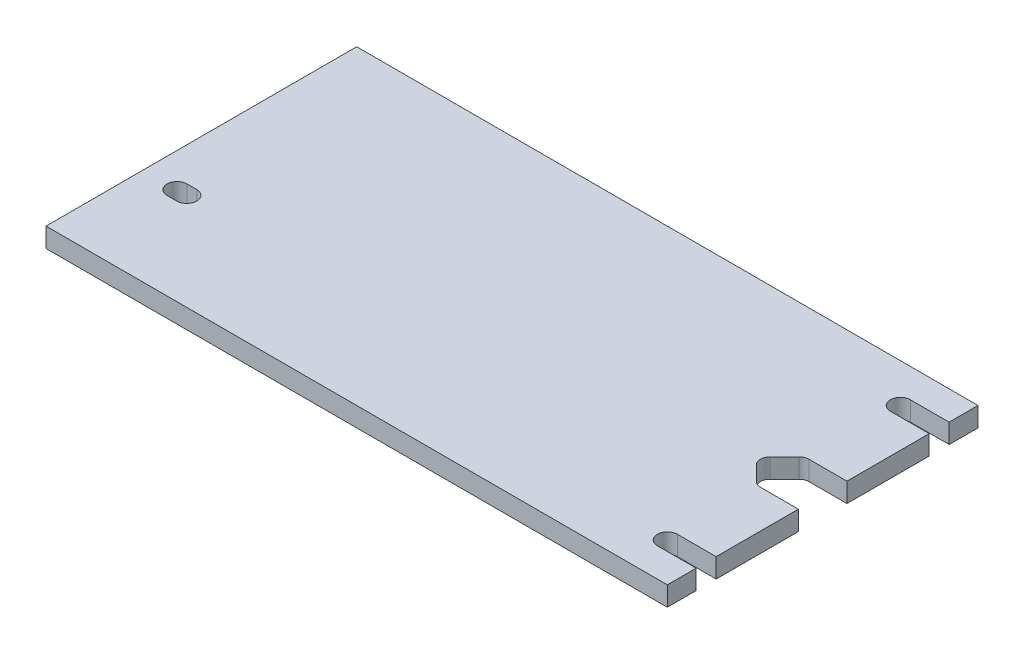
ISO-10303-21;
HEADER;
FILE_DESCRIPTION(('STEP AP214'),'2;1');
FILE_NAME('part.step','',(''),(''),'','','');
FILE_SCHEMA(('AUTOMOTIVE_DESIGN { 1 0 10303 214 1 1 1 1 }'));
ENDSEC;
DATA;
#1=APPLICATION_CONTEXT('core data for automotive mechanical design processes');
#2=APPLICATION_PROTOCOL_DEFINITION('international standard','automotive_design',2000,#1);
#3=PRODUCT_CONTEXT('',#1,'mechanical');
#4=PRODUCT('Part','Part','',(#3));
#5=PRODUCT_RELATED_PRODUCT_CATEGORY('part','',(#4));
#6=PRODUCT_DEFINITION_FORMATION('','',#4);
#7=PRODUCT_DEFINITION_CONTEXT('part definition',#1,'design');
#8=PRODUCT_DEFINITION('design','',#6,#7);
#9=PRODUCT_DEFINITION_SHAPE('','',#8);
#10=(LENGTH_UNIT() NAMED_UNIT(*) SI_UNIT(.MILLI.,.METRE.));
#11=(NAMED_UNIT(*) PLANE_ANGLE_UNIT() SI_UNIT($,.RADIAN.));
#12=(NAMED_UNIT(*) SI_UNIT($,.STERADIAN.) SOLID_ANGLE_UNIT());
#13=UNCERTAINTY_MEASURE_WITH_UNIT(LENGTH_MEASURE(1.E-05),#10,'distance_accuracy_value','');
#14=(GEOMETRIC_REPRESENTATION_CONTEXT(3) GLOBAL_UNCERTAINTY_ASSIGNED_CONTEXT((#13)) GLOBAL_UNIT_ASSIGNED_CONTEXT((#10,
#11,#12)) REPRESENTATION_CONTEXT('',''));
#15=CARTESIAN_POINT('',(0.,0.,0.));
#16=DIRECTION('',(0.,0.,1.));
#17=DIRECTION('',(1.,0.,0.));
#18=AXIS2_PLACEMENT_3D('',#15,#16,#17);
#19=CARTESIAN_POINT('',(101.6,6.35,7.9375));
#20=DIRECTION('',(-1.,0.,0.));
#21=DIRECTION('',(0.,0.,1.));
#22=AXIS2_PLACEMENT_3D('',#19,#20,#21);
#23=PLANE('',#22);
#24=DIRECTION('',(0.,1.,0.));
#25=VECTOR('',#24,1.);
#26=CARTESIAN_POINT('',(101.6,-0.00100000000000013,34.8361));
#27=LINE('',#26,#25);
#28=CARTESIAN_POINT('',(101.6,0.,34.8361));
#29=VERTEX_POINT('',#28);
#30=CARTESIAN_POINT('',(101.6,6.35,34.8361));
#31=VERTEX_POINT('',#30);
#32=EDGE_CURVE('E247',#29,#31,#27,.T.);
#33=ORIENTED_EDGE('',*,*,#32,.F.);
#34=DIRECTION('',(0.,0.,-1.));
#35=VECTOR('',#34,1.);
#36=CARTESIAN_POINT('',(101.6,0.,7.9375));
#37=LINE('',#36,#35);
#38=CARTESIAN_POINT('',(101.6,0.,7.9375));
#39=VERTEX_POINT('',#38);
#40=EDGE_CURVE('E282',#29,#39,#37,.T.);
#41=ORIENTED_EDGE('',*,*,#40,.T.);
#42=DIRECTION('',(0.,-1.,0.));
#43=VECTOR('',#42,1.);
#44=CARTESIAN_POINT('',(101.6,6.35,7.9375));
#45=LINE('',#44,#43);
#46=CARTESIAN_POINT('',(101.6,6.35,7.9375));
#47=VERTEX_POINT('',#46);
#48=EDGE_CURVE('E11',#47,#39,#45,.T.);
#49=ORIENTED_EDGE('',*,*,#48,.F.);
#50=DIRECTION('',(0.,0.,-1.));
#51=VECTOR('',#50,1.);
#52=CARTESIAN_POINT('',(101.6,6.35,7.9375));
#53=LINE('',#52,#51);
#54=EDGE_CURVE('E287',#31,#47,#53,.T.);
#55=ORIENTED_EDGE('',*,*,#54,.F.);
#56=EDGE_LOOP('',(#33,#41,#49,#55));
#57=FACE_BOUND('',#56,.T.);
#58=ADVANCED_FACE('F32',(#57),#23,.F.);
#59=DIRECTION('',(0.,1.,0.));
#60=VECTOR('',#59,1.);
#61=CARTESIAN_POINT('',(101.6,-0.00100000000000013,41.3639));
#62=LINE('',#61,#60);
#63=CARTESIAN_POINT('',(101.6,0.,41.3639));
#64=VERTEX_POINT('',#63);
#65=CARTESIAN_POINT('',(101.6,6.35,41.3639));
#66=VERTEX_POINT('',#65);
#67=EDGE_CURVE('E246',#64,#66,#62,.T.);
#68=ORIENTED_EDGE('',*,*,#67,.T.);
#69=CARTESIAN_POINT('',(101.6,6.35,50.8));
#70=VERTEX_POINT('',#69);
#71=EDGE_CURVE('E283',#70,#66,#53,.T.);
#72=ORIENTED_EDGE('',*,*,#71,.F.);
#73=DIRECTION('',(0.,-1.,0.));
#74=VECTOR('',#73,1.);
#75=CARTESIAN_POINT('',(101.6,6.35,50.8));
#76=LINE('',#75,#74);
#77=CARTESIAN_POINT('',(101.6,0.,50.8));
#78=VERTEX_POINT('',#77);
#79=EDGE_CURVE('E311',#70,#78,#76,.T.);
#80=ORIENTED_EDGE('',*,*,#79,.T.);
#81=EDGE_CURVE('E312',#78,#64,#37,.T.);
#82=ORIENTED_EDGE('',*,*,#81,.T.);
#83=EDGE_LOOP('',(#68,#72,#80,#82));
#84=FACE_BOUND('',#83,.T.);
#85=ADVANCED_FACE('F407',(#84),#23,.F.);
#86=CARTESIAN_POINT('',(89.1723719394654,6.35,-4.7625));
#87=DIRECTION('',(0.,1.,0.));
#88=DIRECTION('',(0.,0.,1.));
#89=AXIS2_PLACEMENT_3D('',#86,#87,#88);
#90=PLANE('',#89);
#91=DIRECTION('',(-1.,0.,0.));
#92=VECTOR('',#91,1.);
#93=CARTESIAN_POINT('',(-90.4875,6.35,15.7861));
#94=LINE('',#93,#92);
#95=CARTESIAN_POINT('',(-87.3125,6.35,15.7861));
#96=VERTEX_POINT('',#95);
#97=CARTESIAN_POINT('',(-90.4875,6.35,15.7861));
#98=VERTEX_POINT('',#97);
#99=EDGE_CURVE('E203',#96,#98,#94,.T.);
#100=ORIENTED_EDGE('',*,*,#99,.F.);
#101=CARTESIAN_POINT('',(-87.3125,6.35,19.05));
#102=DIRECTION('',(0.,1.,0.));
#103=DIRECTION('',(0.,0.,1.));
#104=AXIS2_PLACEMENT_3D('',#101,#102,#103);
#105=CIRCLE('',#104,3.26389999999999);
#106=CARTESIAN_POINT('',(-87.3125,6.35,22.3139));
#107=VERTEX_POINT('',#106);
#108=EDGE_CURVE('E210',#107,#96,#105,.T.);
#109=ORIENTED_EDGE('',*,*,#108,.F.);
#110=DIRECTION('',(1.,0.,0.));
#111=VECTOR('',#110,1.);
#112=CARTESIAN_POINT('',(-90.4875,6.35,22.3139));
#113=LINE('',#112,#111);
#114=CARTESIAN_POINT('',(-90.4875,6.35,22.3139));
#115=VERTEX_POINT('',#114);
#116=EDGE_CURVE('E192',#115,#107,#113,.T.);
#117=ORIENTED_EDGE('',*,*,#116,.F.);
#118=CARTESIAN_POINT('',(-90.4875,6.35,19.05));
#119=DIRECTION('',(0.,1.,0.));
#120=DIRECTION('',(0.,0.,1.));
#121=AXIS2_PLACEMENT_3D('',#118,#119,#120);
#122=CIRCLE('',#121,3.26389999999999);
#123=EDGE_CURVE('E204',#98,#115,#122,.T.);
#124=ORIENTED_EDGE('',*,*,#123,.F.);
#125=EDGE_LOOP('',(#100,#109,#117,#124));
#126=FACE_BOUND('',#125,.T.);
#127=CARTESIAN_POINT('',(88.9,6.35,38.1));
#128=DIRECTION('',(0.,1.,0.));
#129=DIRECTION('',(0.,0.,1.));
#130=AXIS2_PLACEMENT_3D('',#127,#128,#129);
#131=CIRCLE('',#130,3.26389999999999);
#132=CARTESIAN_POINT('',(88.9,6.35,34.8361));
#133=VERTEX_POINT('',#132);
#134=CARTESIAN_POINT('',(88.9,6.35,41.3639));
#135=VERTEX_POINT('',#134);
#136=EDGE_CURVE('E270',#133,#135,#131,.T.);
#137=ORIENTED_EDGE('',*,*,#136,.F.);
#138=DIRECTION('',(1.,0.,0.));
#139=VECTOR('',#138,1.);
#140=CARTESIAN_POINT('',(88.9,6.35,34.8361));
#141=LINE('',#140,#139);
#142=EDGE_CURVE('E46',#133,#31,#141,.T.);
#143=ORIENTED_EDGE('',*,*,#142,.T.);
#144=ORIENTED_EDGE('',*,*,#54,.T.);
#145=DIRECTION('',(-1.,0.,0.));
#146=VECTOR('',#145,1.);
#147=CARTESIAN_POINT('',(89.1723719394654,6.35,7.9375));
#148=LINE('',#147,#146);
#149=CARTESIAN_POINT('',(89.1723719394654,6.35,7.9375));
#150=VERTEX_POINT('',#149);
#151=EDGE_CURVE('E286',#47,#150,#148,.T.);
#152=ORIENTED_EDGE('',*,*,#151,.T.);
#153=CARTESIAN_POINT('',(89.1723719394654,6.35,4.7625));
#154=DIRECTION('',(0.,-1.,0.));
#155=DIRECTION('',(0.,0.,1.));
#156=AXIS2_PLACEMENT_3D('',#153,#154,#155);
#157=CIRCLE('',#156,3.175);
#158=CARTESIAN_POINT('',(86.9273079091981,6.35,7.00756403026728));
#159=VERTEX_POINT('',#158);
#160=EDGE_CURVE('E289',#150,#159,#157,.T.);
#161=ORIENTED_EDGE('',*,*,#160,.T.);
#162=DIRECTION('',(-0.707106781186548,0.,-0.707106781186547));
#163=VECTOR('',#162,1.);
#164=CARTESIAN_POINT('',(86.9273079091981,6.35,7.00756403026728));
#165=LINE('',#164,#163);
#166=CARTESIAN_POINT('',(82.1648079091981,6.35,2.24506403026729));
#167=VERTEX_POINT('',#166);
#168=EDGE_CURVE('E291',#159,#167,#165,.T.);
#169=ORIENTED_EDGE('',*,*,#168,.T.);
#170=CARTESIAN_POINT('',(84.4098719394654,6.35,0.));
#171=DIRECTION('',(0.,-1.,0.));
#172=DIRECTION('',(0.,0.,1.));
#173=AXIS2_PLACEMENT_3D('',#170,#171,#172);
#174=CIRCLE('',#173,3.175);
#175=CARTESIAN_POINT('',(82.1648079091981,6.35,-2.24506403026729));
#176=VERTEX_POINT('',#175);
#177=EDGE_CURVE('E293',#167,#176,#174,.T.);
#178=ORIENTED_EDGE('',*,*,#177,.T.);
#179=DIRECTION('',(0.707106781186548,0.,-0.707106781186547));
#180=VECTOR('',#179,1.);
#181=CARTESIAN_POINT('',(86.9273079091981,6.35,-7.00756403026728));
#182=LINE('',#181,#180);
#183=CARTESIAN_POINT('',(86.9273079091981,6.35,-7.00756403026728));
#184=VERTEX_POINT('',#183);
#185=EDGE_CURVE('E295',#176,#184,#182,.T.);
#186=ORIENTED_EDGE('',*,*,#185,.T.);
#187=CARTESIAN_POINT('',(89.1723719394654,6.35,-4.7625));
#188=DIRECTION('',(0.,-1.,0.));
#189=DIRECTION('',(0.,0.,1.));
#190=AXIS2_PLACEMENT_3D('',#187,#188,#189);
#191=CIRCLE('',#190,3.175);
#192=CARTESIAN_POINT('',(89.1723719394654,6.35,-7.9375));
#193=VERTEX_POINT('',#192);
#194=EDGE_CURVE('E297',#184,#193,#191,.T.);
#195=ORIENTED_EDGE('',*,*,#194,.T.);
#196=DIRECTION('',(1.,0.,0.));
#197=VECTOR('',#196,1.);
#198=CARTESIAN_POINT('',(89.1723719394654,6.35,-7.9375));
#199=LINE('',#198,#197);
#200=CARTESIAN_POINT('',(101.6,6.35,-7.9375));
#201=VERTEX_POINT('',#200);
#202=EDGE_CURVE('E299',#193,#201,#199,.T.);
#203=ORIENTED_EDGE('',*,*,#202,.T.);
#204=DIRECTION('',(0.,0.,-1.));
#205=VECTOR('',#204,1.);
#206=CARTESIAN_POINT('',(101.6,6.35,-50.8));
#207=LINE('',#206,#205);
#208=CARTESIAN_POINT('',(101.6,6.35,-34.8361));
#209=VERTEX_POINT('',#208);
#210=EDGE_CURVE('E302',#201,#209,#207,.T.);
#211=ORIENTED_EDGE('',*,*,#210,.T.);
#212=DIRECTION('',(1.,0.,0.));
#213=VECTOR('',#212,1.);
#214=CARTESIAN_POINT('',(88.9,6.35,-34.8361));
#215=LINE('',#214,#213);
#216=CARTESIAN_POINT('',(88.9,6.35,-34.8361));
#217=VERTEX_POINT('',#216);
#218=EDGE_CURVE('E259',#217,#209,#215,.T.);
#219=ORIENTED_EDGE('',*,*,#218,.F.);
#220=CARTESIAN_POINT('',(88.9,6.35,-38.1));
#221=DIRECTION('',(0.,1.,0.));
#222=DIRECTION('',(0.,0.,1.));
#223=AXIS2_PLACEMENT_3D('',#220,#221,#222);
#224=CIRCLE('',#223,3.26389999999999);
#225=CARTESIAN_POINT('',(88.9,6.35,-41.3639));
#226=VERTEX_POINT('',#225);
#227=EDGE_CURVE('E276',#226,#217,#224,.T.);
#228=ORIENTED_EDGE('',*,*,#227,.F.);
#229=DIRECTION('',(-1.,0.,0.));
#230=VECTOR('',#229,1.);
#231=CARTESIAN_POINT('',(88.9,6.35,-41.3639));
#232=LINE('',#231,#230);
#233=CARTESIAN_POINT('',(101.6,6.35,-41.3639));
#234=VERTEX_POINT('',#233);
#235=EDGE_CURVE('E261',#234,#226,#232,.T.);
#236=ORIENTED_EDGE('',*,*,#235,.F.);
#237=CARTESIAN_POINT('',(101.6,6.35,-50.8));
#238=VERTEX_POINT('',#237);
#239=EDGE_CURVE('E301',#234,#238,#207,.T.);
#240=ORIENTED_EDGE('',*,*,#239,.T.);
#241=DIRECTION('',(-1.,0.,0.));
#242=VECTOR('',#241,1.);
#243=CARTESIAN_POINT('',(-101.6,6.35,-50.8));
#244=LINE('',#243,#242);
#245=CARTESIAN_POINT('',(-101.6,6.35,-50.8));
#246=VERTEX_POINT('',#245);
#247=EDGE_CURVE('E305',#238,#246,#244,.T.);
#248=ORIENTED_EDGE('',*,*,#247,.T.);
#249=DIRECTION('',(0.,0.,1.));
#250=VECTOR('',#249,1.);
#251=CARTESIAN_POINT('',(-101.6,6.35,-50.8));
#252=LINE('',#251,#250);
#253=CARTESIAN_POINT('',(-101.6,6.35,50.8));
#254=VERTEX_POINT('',#253);
#255=EDGE_CURVE('E307',#246,#254,#252,.T.);
#256=ORIENTED_EDGE('',*,*,#255,.T.);
#257=DIRECTION('',(1.,0.,0.));
#258=VECTOR('',#257,1.);
#259=CARTESIAN_POINT('',(-101.6,6.35,50.8));
#260=LINE('',#259,#258);
#261=EDGE_CURVE('E309',#254,#70,#260,.T.);
#262=ORIENTED_EDGE('',*,*,#261,.T.);
#263=ORIENTED_EDGE('',*,*,#71,.T.);
#264=DIRECTION('',(-1.,0.,0.));
#265=VECTOR('',#264,1.);
#266=CARTESIAN_POINT('',(88.9,6.35,41.3639));
#267=LINE('',#266,#265);
#268=EDGE_CURVE('E242',#66,#135,#267,.T.);
#269=ORIENTED_EDGE('',*,*,#268,.T.);
#270=EDGE_LOOP('',(#137,#143,#144,#152,#161,#169,#178,#186,#195,#203,#211,#219,#228,#236,#240,
#248,#256,#262,#263,#269));
#271=FACE_BOUND('',#270,.T.);
#272=ADVANCED_FACE('F215',(#126,#271),#90,.T.);
#273=CARTESIAN_POINT('',(89.1723719394654,0.,-4.7625));
#274=DIRECTION('',(0.,1.,0.));
#275=DIRECTION('',(0.,0.,1.));
#276=AXIS2_PLACEMENT_3D('',#273,#274,#275);
#277=PLANE('',#276);
#278=CARTESIAN_POINT('',(-87.3125,0.,19.05));
#279=DIRECTION('',(0.,1.,0.));
#280=DIRECTION('',(0.,0.,1.));
#281=AXIS2_PLACEMENT_3D('',#278,#279,#280);
#282=CIRCLE('',#281,3.26389999999999);
#283=CARTESIAN_POINT('',(-87.3125,0.,15.7861));
#284=VERTEX_POINT('',#283);
#285=CARTESIAN_POINT('',(-87.3125,0.,22.3139));
#286=VERTEX_POINT('',#285);
#287=EDGE_CURVE('E212',#284,#286,#282,.F.);
#288=ORIENTED_EDGE('',*,*,#287,.F.);
#289=DIRECTION('',(1.,0.,0.));
#290=VECTOR('',#289,1.);
#291=CARTESIAN_POINT('',(-90.4875,0.,15.7861));
#292=LINE('',#291,#290);
#293=CARTESIAN_POINT('',(-90.4875,0.,15.7861));
#294=VERTEX_POINT('',#293);
#295=EDGE_CURVE('E219',#294,#284,#292,.T.);
#296=ORIENTED_EDGE('',*,*,#295,.F.);
#297=CARTESIAN_POINT('',(-90.4875,0.,19.05));
#298=DIRECTION('',(0.,1.,0.));
#299=DIRECTION('',(0.,0.,1.));
#300=AXIS2_PLACEMENT_3D('',#297,#298,#299);
#301=CIRCLE('',#300,3.26389999999999);
#302=CARTESIAN_POINT('',(-90.4875,0.,22.3139));
#303=VERTEX_POINT('',#302);
#304=EDGE_CURVE('E221',#303,#294,#301,.F.);
#305=ORIENTED_EDGE('',*,*,#304,.F.);
#306=DIRECTION('',(-1.,0.,0.));
#307=VECTOR('',#306,1.);
#308=CARTESIAN_POINT('',(-90.4875,0.,22.3139));
#309=LINE('',#308,#307);
#310=EDGE_CURVE('E232',#286,#303,#309,.T.);
#311=ORIENTED_EDGE('',*,*,#310,.F.);
#312=EDGE_LOOP('',(#288,#296,#305,#311));
#313=FACE_BOUND('',#312,.T.);
#314=DIRECTION('',(-1.,0.,0.));
#315=VECTOR('',#314,1.);
#316=CARTESIAN_POINT('',(88.9,0.,34.8361));
#317=LINE('',#316,#315);
#318=CARTESIAN_POINT('',(88.9,0.,34.8361));
#319=VERTEX_POINT('',#318);
#320=EDGE_CURVE('E239',#29,#319,#317,.T.);
#321=ORIENTED_EDGE('',*,*,#320,.T.);
#322=CARTESIAN_POINT('',(88.9,0.,38.1));
#323=DIRECTION('',(0.,1.,0.));
#324=DIRECTION('',(0.,0.,1.));
#325=AXIS2_PLACEMENT_3D('',#322,#323,#324);
#326=CIRCLE('',#325,3.26389999999999);
#327=CARTESIAN_POINT('',(88.9,0.,41.3639));
#328=VERTEX_POINT('',#327);
#329=EDGE_CURVE('E273',#319,#328,#326,.T.);
#330=ORIENTED_EDGE('',*,*,#329,.T.);
#331=DIRECTION('',(1.,0.,0.));
#332=VECTOR('',#331,1.);
#333=CARTESIAN_POINT('',(88.9,0.,41.3639));
#334=LINE('',#333,#332);
#335=EDGE_CURVE('E54',#328,#64,#334,.T.);
#336=ORIENTED_EDGE('',*,*,#335,.T.);
#337=ORIENTED_EDGE('',*,*,#81,.F.);
#338=DIRECTION('',(1.,0.,0.));
#339=VECTOR('',#338,1.);
#340=CARTESIAN_POINT('',(-101.6,0.,50.8));
#341=LINE('',#340,#339);
#342=CARTESIAN_POINT('',(-101.6,0.,50.8));
#343=VERTEX_POINT('',#342);
#344=EDGE_CURVE('E337',#343,#78,#341,.T.);
#345=ORIENTED_EDGE('',*,*,#344,.F.);
#346=DIRECTION('',(0.,0.,1.));
#347=VECTOR('',#346,1.);
#348=CARTESIAN_POINT('',(-101.6,0.,-50.8));
#349=LINE('',#348,#347);
#350=CARTESIAN_POINT('',(-101.6,0.,-50.8));
#351=VERTEX_POINT('',#350);
#352=EDGE_CURVE('E335',#351,#343,#349,.T.);
#353=ORIENTED_EDGE('',*,*,#352,.F.);
#354=DIRECTION('',(-1.,0.,0.));
#355=VECTOR('',#354,1.);
#356=CARTESIAN_POINT('',(-101.6,0.,-50.8));
#357=LINE('',#356,#355);
#358=CARTESIAN_POINT('',(101.6,0.,-50.8));
#359=VERTEX_POINT('',#358);
#360=EDGE_CURVE('E333',#359,#351,#357,.T.);
#361=ORIENTED_EDGE('',*,*,#360,.F.);
#362=DIRECTION('',(0.,0.,-1.));
#363=VECTOR('',#362,1.);
#364=CARTESIAN_POINT('',(101.6,0.,-50.8));
#365=LINE('',#364,#363);
#366=CARTESIAN_POINT('',(101.6,0.,-41.3639));
#367=VERTEX_POINT('',#366);
#368=EDGE_CURVE('E329',#367,#359,#365,.T.);
#369=ORIENTED_EDGE('',*,*,#368,.F.);
#370=DIRECTION('',(1.,0.,0.));
#371=VECTOR('',#370,1.);
#372=CARTESIAN_POINT('',(88.9,0.,-41.3639));
#373=LINE('',#372,#371);
#374=CARTESIAN_POINT('',(88.9,0.,-41.3639));
#375=VERTEX_POINT('',#374);
#376=EDGE_CURVE('E257',#375,#367,#373,.T.);
#377=ORIENTED_EDGE('',*,*,#376,.F.);
#378=CARTESIAN_POINT('',(88.9,0.,-38.1));
#379=DIRECTION('',(0.,1.,0.));
#380=DIRECTION('',(0.,0.,1.));
#381=AXIS2_PLACEMENT_3D('',#378,#379,#380);
#382=CIRCLE('',#381,3.26389999999999);
#383=CARTESIAN_POINT('',(88.9,0.,-34.8361));
#384=VERTEX_POINT('',#383);
#385=EDGE_CURVE('E279',#375,#384,#382,.T.);
#386=ORIENTED_EDGE('',*,*,#385,.T.);
#387=DIRECTION('',(-1.,0.,0.));
#388=VECTOR('',#387,1.);
#389=CARTESIAN_POINT('',(88.9,0.,-34.8361));
#390=LINE('',#389,#388);
#391=CARTESIAN_POINT('',(101.6,0.,-34.8361));
#392=VERTEX_POINT('',#391);
#393=EDGE_CURVE('E266',#392,#384,#390,.T.);
#394=ORIENTED_EDGE('',*,*,#393,.F.);
#395=CARTESIAN_POINT('',(101.6,0.,-7.9375));
#396=VERTEX_POINT('',#395);
#397=EDGE_CURVE('E330',#396,#392,#365,.T.);
#398=ORIENTED_EDGE('',*,*,#397,.F.);
#399=DIRECTION('',(1.,0.,0.));
#400=VECTOR('',#399,1.);
#401=CARTESIAN_POINT('',(89.1723719394654,0.,-7.9375));
#402=LINE('',#401,#400);
#403=CARTESIAN_POINT('',(89.1723719394654,0.,-7.9375));
#404=VERTEX_POINT('',#403);
#405=EDGE_CURVE('E327',#404,#396,#402,.T.);
#406=ORIENTED_EDGE('',*,*,#405,.F.);
#407=CARTESIAN_POINT('',(89.1723719394654,0.,-4.7625));
#408=DIRECTION('',(0.,-1.,0.));
#409=DIRECTION('',(0.,0.,1.));
#410=AXIS2_PLACEMENT_3D('',#407,#408,#409);
#411=CIRCLE('',#410,3.175);
#412=CARTESIAN_POINT('',(86.9273079091981,0.,-7.00756403026728));
#413=VERTEX_POINT('',#412);
#414=EDGE_CURVE('E325',#413,#404,#411,.T.);
#415=ORIENTED_EDGE('',*,*,#414,.F.);
#416=DIRECTION('',(0.707106781186548,0.,-0.707106781186547));
#417=VECTOR('',#416,1.);
#418=CARTESIAN_POINT('',(86.9273079091981,0.,-7.00756403026728));
#419=LINE('',#418,#417);
#420=CARTESIAN_POINT('',(82.1648079091981,0.,-2.24506403026729));
#421=VERTEX_POINT('',#420);
#422=EDGE_CURVE('E323',#421,#413,#419,.T.);
#423=ORIENTED_EDGE('',*,*,#422,.F.);
#424=CARTESIAN_POINT('',(84.4098719394654,0.,0.));
#425=DIRECTION('',(0.,-1.,0.));
#426=DIRECTION('',(0.,0.,1.));
#427=AXIS2_PLACEMENT_3D('',#424,#425,#426);
#428=CIRCLE('',#427,3.175);
#429=CARTESIAN_POINT('',(82.1648079091981,0.,2.24506403026729));
#430=VERTEX_POINT('',#429);
#431=EDGE_CURVE('E321',#430,#421,#428,.T.);
#432=ORIENTED_EDGE('',*,*,#431,.F.);
#433=DIRECTION('',(-0.707106781186548,0.,-0.707106781186547));
#434=VECTOR('',#433,1.);
#435=CARTESIAN_POINT('',(86.9273079091981,0.,7.00756403026728));
#436=LINE('',#435,#434);
#437=CARTESIAN_POINT('',(86.9273079091981,0.,7.00756403026728));
#438=VERTEX_POINT('',#437);
#439=EDGE_CURVE('E319',#438,#430,#436,.T.);
#440=ORIENTED_EDGE('',*,*,#439,.F.);
#441=CARTESIAN_POINT('',(89.1723719394654,0.,4.7625));
#442=DIRECTION('',(0.,-1.,0.));
#443=DIRECTION('',(0.,0.,1.));
#444=AXIS2_PLACEMENT_3D('',#441,#442,#443);
#445=CIRCLE('',#444,3.175);
#446=CARTESIAN_POINT('',(89.1723719394654,0.,7.9375));
#447=VERTEX_POINT('',#446);
#448=EDGE_CURVE('E317',#447,#438,#445,.T.);
#449=ORIENTED_EDGE('',*,*,#448,.F.);
#450=DIRECTION('',(-1.,0.,0.));
#451=VECTOR('',#450,1.);
#452=CARTESIAN_POINT('',(89.1723719394654,0.,7.9375));
#453=LINE('',#452,#451);
#454=EDGE_CURVE('E315',#39,#447,#453,.T.);
#455=ORIENTED_EDGE('',*,*,#454,.F.);
#456=ORIENTED_EDGE('',*,*,#40,.F.);
#457=EDGE_LOOP('',(#321,#330,#336,#337,#345,#353,#361,#369,#377,#386,#394,#398,#406,#415,#423,
#432,#440,#449,#455,#456));
#458=FACE_BOUND('',#457,.T.);
#459=ADVANCED_FACE('F379',(#313,#458),#277,.F.);
#460=CARTESIAN_POINT('',(88.9,6.35,38.1));
#461=DIRECTION('',(0.,1.,0.));
#462=DIRECTION('',(0.,0.,1.));
#463=AXIS2_PLACEMENT_3D('',#460,#461,#462);
#464=CYLINDRICAL_SURFACE('',#463,3.26389999999999);
#465=DIRECTION('',(0.,1.,0.));
#466=VECTOR('',#465,1.);
#467=CARTESIAN_POINT('',(88.9,6.35,34.8361));
#468=LINE('',#467,#466);
#469=EDGE_CURVE('E237',#319,#133,#468,.T.);
#470=ORIENTED_EDGE('',*,*,#469,.T.);
#471=ORIENTED_EDGE('',*,*,#136,.T.);
#472=DIRECTION('',(0.,1.,0.));
#473=VECTOR('',#472,1.);
#474=CARTESIAN_POINT('',(88.9,6.35,41.3639));
#475=LINE('',#474,#473);
#476=EDGE_CURVE('E235',#328,#135,#475,.T.);
#477=ORIENTED_EDGE('',*,*,#476,.F.);
#478=ORIENTED_EDGE('',*,*,#329,.F.);
#479=EDGE_LOOP('',(#470,#471,#477,#478));
#480=FACE_BOUND('',#479,.T.);
#481=ADVANCED_FACE('F401',(#480),#464,.F.);
#482=CARTESIAN_POINT('',(101.6,6.35,-50.8));
#483=DIRECTION('',(-1.,0.,0.));
#484=DIRECTION('',(0.,0.,1.));
#485=AXIS2_PLACEMENT_3D('',#482,#483,#484);
#486=PLANE('',#485);
#487=ORIENTED_EDGE('',*,*,#239,.F.);
#488=DIRECTION('',(0.,1.,0.));
#489=VECTOR('',#488,1.);
#490=CARTESIAN_POINT('',(101.6,-0.00100000000000013,-41.3639));
#491=LINE('',#490,#489);
#492=EDGE_CURVE('E264',#367,#234,#491,.T.);
#493=ORIENTED_EDGE('',*,*,#492,.F.);
#494=ORIENTED_EDGE('',*,*,#368,.T.);
#495=DIRECTION('',(0.,-1.,0.));
#496=VECTOR('',#495,1.);
#497=CARTESIAN_POINT('',(101.6,6.35,-50.8));
#498=LINE('',#497,#496);
#499=EDGE_CURVE('E347',#238,#359,#498,.T.);
#500=ORIENTED_EDGE('',*,*,#499,.F.);
#501=EDGE_LOOP('',(#487,#493,#494,#500));
#502=FACE_BOUND('',#501,.T.);
#503=ADVANCED_FACE('F429',(#502),#486,.F.);
#504=CARTESIAN_POINT('',(88.9,6.35,-38.1));
#505=DIRECTION('',(0.,1.,0.));
#506=DIRECTION('',(0.,0.,1.));
#507=AXIS2_PLACEMENT_3D('',#504,#505,#506);
#508=CYLINDRICAL_SURFACE('',#507,3.26389999999999);
#509=DIRECTION('',(0.,1.,0.));
#510=VECTOR('',#509,1.);
#511=CARTESIAN_POINT('',(88.9,6.35,-41.3639));
#512=LINE('',#511,#510);
#513=EDGE_CURVE('E254',#375,#226,#512,.T.);
#514=ORIENTED_EDGE('',*,*,#513,.T.);
#515=ORIENTED_EDGE('',*,*,#227,.T.);
#516=DIRECTION('',(0.,1.,0.));
#517=VECTOR('',#516,1.);
#518=CARTESIAN_POINT('',(88.9,6.35,-34.8361));
#519=LINE('',#518,#517);
#520=EDGE_CURVE('E252',#384,#217,#519,.T.);
#521=ORIENTED_EDGE('',*,*,#520,.F.);
#522=ORIENTED_EDGE('',*,*,#385,.F.);
#523=EDGE_LOOP('',(#514,#515,#521,#522));
#524=FACE_BOUND('',#523,.T.);
#525=ADVANCED_FACE('F437',(#524),#508,.F.);
#526=CARTESIAN_POINT('',(89.1723719394654,6.35,7.9375));
#527=DIRECTION('',(0.,0.,1.));
#528=DIRECTION('',(1.,0.,0.));
#529=AXIS2_PLACEMENT_3D('',#526,#527,#528);
#530=PLANE('',#529);
#531=ORIENTED_EDGE('',*,*,#454,.T.);
#532=DIRECTION('',(0.,-1.,0.));
#533=VECTOR('',#532,1.);
#534=CARTESIAN_POINT('',(89.1723719394654,6.35,7.9375));
#535=LINE('',#534,#533);
#536=EDGE_CURVE('E39',#150,#447,#535,.T.);
#537=ORIENTED_EDGE('',*,*,#536,.F.);
#538=ORIENTED_EDGE('',*,*,#151,.F.);
#539=ORIENTED_EDGE('',*,*,#48,.T.);
#540=EDGE_LOOP('',(#531,#537,#538,#539));
#541=FACE_BOUND('',#540,.T.);
#542=ADVANCED_FACE('F396',(#541),#530,.F.);
#543=CARTESIAN_POINT('',(89.1723719394654,6.35,4.7625));
#544=DIRECTION('',(0.,-1.,0.));
#545=DIRECTION('',(0.,0.,-1.));
#546=AXIS2_PLACEMENT_3D('',#543,#544,#545);
#547=CYLINDRICAL_SURFACE('',#546,3.175);
#548=ORIENTED_EDGE('',*,*,#448,.T.);
#549=DIRECTION('',(0.,-1.,0.));
#550=VECTOR('',#549,1.);
#551=CARTESIAN_POINT('',(86.9273079091981,6.35,7.00756403026728));
#552=LINE('',#551,#550);
#553=EDGE_CURVE('E365',#159,#438,#552,.T.);
#554=ORIENTED_EDGE('',*,*,#553,.F.);
#555=ORIENTED_EDGE('',*,*,#160,.F.);
#556=ORIENTED_EDGE('',*,*,#536,.T.);
#557=EDGE_LOOP('',(#548,#554,#555,#556));
#558=FACE_BOUND('',#557,.T.);
#559=ADVANCED_FACE('F372',(#558),#547,.F.);
#560=CARTESIAN_POINT('',(86.9273079091981,6.35,7.00756403026728));
#561=DIRECTION('',(-0.707106781186547,0.,0.707106781186548));
#562=DIRECTION('',(0.707106781186548,0.,0.707106781186547));
#563=AXIS2_PLACEMENT_3D('',#560,#561,#562);
#564=PLANE('',#563);
#565=ORIENTED_EDGE('',*,*,#439,.T.);
#566=DIRECTION('',(0.,-1.,0.));
#567=VECTOR('',#566,1.);
#568=CARTESIAN_POINT('',(82.1648079091981,6.35,2.24506403026729));
#569=LINE('',#568,#567);
#570=EDGE_CURVE('E362',#167,#430,#569,.T.);
#571=ORIENTED_EDGE('',*,*,#570,.F.);
#572=ORIENTED_EDGE('',*,*,#168,.F.);
#573=ORIENTED_EDGE('',*,*,#553,.T.);
#574=EDGE_LOOP('',(#565,#571,#572,#573));
#575=FACE_BOUND('',#574,.T.);
#576=ADVANCED_FACE('F385',(#575),#564,.F.);
#577=CARTESIAN_POINT('',(84.4098719394654,6.35,0.));
#578=DIRECTION('',(0.,-1.,0.));
#579=DIRECTION('',(0.,0.,-1.));
#580=AXIS2_PLACEMENT_3D('',#577,#578,#579);
#581=CYLINDRICAL_SURFACE('',#580,3.175);
#582=ORIENTED_EDGE('',*,*,#431,.T.);
#583=DIRECTION('',(0.,-1.,0.));
#584=VECTOR('',#583,1.);
#585=CARTESIAN_POINT('',(82.1648079091981,6.35,-2.24506403026729));
#586=LINE('',#585,#584);
#587=EDGE_CURVE('E359',#176,#421,#586,.T.);
#588=ORIENTED_EDGE('',*,*,#587,.F.);
#589=ORIENTED_EDGE('',*,*,#177,.F.);
#590=ORIENTED_EDGE('',*,*,#570,.T.);
#591=EDGE_LOOP('',(#582,#588,#589,#590));
#592=FACE_BOUND('',#591,.T.);
#593=ADVANCED_FACE('F389',(#592),#581,.F.);
#594=CARTESIAN_POINT('',(86.9273079091981,6.35,-7.00756403026728));
#595=DIRECTION('',(-0.707106781186547,0.,-0.707106781186548));
#596=DIRECTION('',(-0.707106781186548,0.,0.707106781186547));
#597=AXIS2_PLACEMENT_3D('',#594,#595,#596);
#598=PLANE('',#597);
#599=ORIENTED_EDGE('',*,*,#422,.T.);
#600=DIRECTION('',(0.,-1.,0.));
#601=VECTOR('',#600,1.);
#602=CARTESIAN_POINT('',(86.9273079091981,6.35,-7.00756403026728));
#603=LINE('',#602,#601);
#604=EDGE_CURVE('E356',#184,#413,#603,.T.);
#605=ORIENTED_EDGE('',*,*,#604,.F.);
#606=ORIENTED_EDGE('',*,*,#185,.F.);
#607=ORIENTED_EDGE('',*,*,#587,.T.);
#608=EDGE_LOOP('',(#599,#605,#606,#607));
#609=FACE_BOUND('',#608,.T.);
#610=ADVANCED_FACE('F455',(#609),#598,.F.);
#611=CARTESIAN_POINT('',(89.1723719394654,6.35,-4.7625));
#612=DIRECTION('',(0.,-1.,0.));
#613=DIRECTION('',(0.,0.,-1.));
#614=AXIS2_PLACEMENT_3D('',#611,#612,#613);
#615=CYLINDRICAL_SURFACE('',#614,3.175);
#616=ORIENTED_EDGE('',*,*,#414,.T.);
#617=DIRECTION('',(0.,-1.,0.));
#618=VECTOR('',#617,1.);
#619=CARTESIAN_POINT('',(89.1723719394654,6.35,-7.9375));
#620=LINE('',#619,#618);
#621=EDGE_CURVE('E353',#193,#404,#620,.T.);
#622=ORIENTED_EDGE('',*,*,#621,.F.);
#623=ORIENTED_EDGE('',*,*,#194,.F.);
#624=ORIENTED_EDGE('',*,*,#604,.T.);
#625=EDGE_LOOP('',(#616,#622,#623,#624));
#626=FACE_BOUND('',#625,.T.);
#627=ADVANCED_FACE('F452',(#626),#615,.F.);
#628=CARTESIAN_POINT('',(89.1723719394654,6.35,-7.9375));
#629=DIRECTION('',(0.,0.,-1.));
#630=DIRECTION('',(-1.,0.,0.));
#631=AXIS2_PLACEMENT_3D('',#628,#629,#630);
#632=PLANE('',#631);
#633=ORIENTED_EDGE('',*,*,#405,.T.);
#634=DIRECTION('',(0.,-1.,0.));
#635=VECTOR('',#634,1.);
#636=CARTESIAN_POINT('',(101.6,6.35,-7.9375));
#637=LINE('',#636,#635);
#638=EDGE_CURVE('E350',#201,#396,#637,.T.);
#639=ORIENTED_EDGE('',*,*,#638,.F.);
#640=ORIENTED_EDGE('',*,*,#202,.F.);
#641=ORIENTED_EDGE('',*,*,#621,.T.);
#642=EDGE_LOOP('',(#633,#639,#640,#641));
#643=FACE_BOUND('',#642,.T.);
#644=ADVANCED_FACE('F448',(#643),#632,.F.);
#645=ORIENTED_EDGE('',*,*,#397,.T.);
#646=DIRECTION('',(0.,1.,0.));
#647=VECTOR('',#646,1.);
#648=CARTESIAN_POINT('',(101.6,-0.00100000000000013,-34.8361));
#649=LINE('',#648,#647);
#650=EDGE_CURVE('E263',#392,#209,#649,.T.);
#651=ORIENTED_EDGE('',*,*,#650,.T.);
#652=ORIENTED_EDGE('',*,*,#210,.F.);
#653=ORIENTED_EDGE('',*,*,#638,.T.);
#654=EDGE_LOOP('',(#645,#651,#652,#653));
#655=FACE_BOUND('',#654,.T.);
#656=ADVANCED_FACE('F443',(#655),#486,.F.);
#657=CARTESIAN_POINT('',(-101.6,6.35,-50.8));
#658=DIRECTION('',(0.,0.,1.));
#659=DIRECTION('',(1.,0.,0.));
#660=AXIS2_PLACEMENT_3D('',#657,#658,#659);
#661=PLANE('',#660);
#662=ORIENTED_EDGE('',*,*,#360,.T.);
#663=DIRECTION('',(0.,-1.,0.));
#664=VECTOR('',#663,1.);
#665=CARTESIAN_POINT('',(-101.6,6.35,-50.8));
#666=LINE('',#665,#664);
#667=EDGE_CURVE('E344',#246,#351,#666,.T.);
#668=ORIENTED_EDGE('',*,*,#667,.F.);
#669=ORIENTED_EDGE('',*,*,#247,.F.);
#670=ORIENTED_EDGE('',*,*,#499,.T.);
#671=EDGE_LOOP('',(#662,#668,#669,#670));
#672=FACE_BOUND('',#671,.T.);
#673=ADVANCED_FACE('F421',(#672),#661,.F.);
#674=CARTESIAN_POINT('',(-101.6,6.35,-50.8));
#675=DIRECTION('',(1.,0.,0.));
#676=DIRECTION('',(0.,0.,-1.));
#677=AXIS2_PLACEMENT_3D('',#674,#675,#676);
#678=PLANE('',#677);
#679=ORIENTED_EDGE('',*,*,#352,.T.);
#680=DIRECTION('',(0.,-1.,0.));
#681=VECTOR('',#680,1.);
#682=CARTESIAN_POINT('',(-101.6,6.35,50.8));
#683=LINE('',#682,#681);
#684=EDGE_CURVE('E341',#254,#343,#683,.T.);
#685=ORIENTED_EDGE('',*,*,#684,.F.);
#686=ORIENTED_EDGE('',*,*,#255,.F.);
#687=ORIENTED_EDGE('',*,*,#667,.T.);
#688=EDGE_LOOP('',(#679,#685,#686,#687));
#689=FACE_BOUND('',#688,.T.);
#690=ADVANCED_FACE('F417',(#689),#678,.F.);
#691=CARTESIAN_POINT('',(-101.6,6.35,50.8));
#692=DIRECTION('',(0.,0.,-1.));
#693=DIRECTION('',(-1.,0.,0.));
#694=AXIS2_PLACEMENT_3D('',#691,#692,#693);
#695=PLANE('',#694);
#696=ORIENTED_EDGE('',*,*,#344,.T.);
#697=ORIENTED_EDGE('',*,*,#79,.F.);
#698=ORIENTED_EDGE('',*,*,#261,.F.);
#699=ORIENTED_EDGE('',*,*,#684,.T.);
#700=EDGE_LOOP('',(#696,#697,#698,#699));
#701=FACE_BOUND('',#700,.T.);
#702=ADVANCED_FACE('F413',(#701),#695,.F.);
#703=CARTESIAN_POINT('',(88.9,-0.00100000000000013,-34.8361));
#704=DIRECTION('',(0.,0.,1.));
#705=DIRECTION('',(1.,0.,0.));
#706=AXIS2_PLACEMENT_3D('',#703,#704,#705);
#707=PLANE('',#706);
#708=ORIENTED_EDGE('',*,*,#393,.T.);
#709=ORIENTED_EDGE('',*,*,#520,.T.);
#710=ORIENTED_EDGE('',*,*,#218,.T.);
#711=ORIENTED_EDGE('',*,*,#650,.F.);
#712=EDGE_LOOP('',(#708,#709,#710,#711));
#713=FACE_BOUND('',#712,.T.);
#714=ADVANCED_FACE('F482',(#713),#707,.F.);
#715=CARTESIAN_POINT('',(88.9,-0.00100000000000013,-41.3639));
#716=DIRECTION('',(0.,0.,-1.));
#717=DIRECTION('',(-1.,0.,0.));
#718=AXIS2_PLACEMENT_3D('',#715,#716,#717);
#719=PLANE('',#718);
#720=ORIENTED_EDGE('',*,*,#376,.T.);
#721=ORIENTED_EDGE('',*,*,#492,.T.);
#722=ORIENTED_EDGE('',*,*,#235,.T.);
#723=ORIENTED_EDGE('',*,*,#513,.F.);
#724=EDGE_LOOP('',(#720,#721,#722,#723));
#725=FACE_BOUND('',#724,.T.);
#726=ADVANCED_FACE('F432',(#725),#719,.F.);
#727=CARTESIAN_POINT('',(88.9,-0.00100000000000013,41.3639));
#728=DIRECTION('',(0.,0.,-1.));
#729=DIRECTION('',(-1.,0.,0.));
#730=AXIS2_PLACEMENT_3D('',#727,#728,#729);
#731=PLANE('',#730);
#732=ORIENTED_EDGE('',*,*,#476,.T.);
#733=ORIENTED_EDGE('',*,*,#268,.F.);
#734=ORIENTED_EDGE('',*,*,#67,.F.);
#735=ORIENTED_EDGE('',*,*,#335,.F.);
#736=EDGE_LOOP('',(#732,#733,#734,#735));
#737=FACE_BOUND('',#736,.T.);
#738=ADVANCED_FACE('F402',(#737),#731,.T.);
#739=CARTESIAN_POINT('',(88.9,-0.00100000000000013,34.8361));
#740=DIRECTION('',(0.,0.,1.));
#741=DIRECTION('',(1.,0.,0.));
#742=AXIS2_PLACEMENT_3D('',#739,#740,#741);
#743=PLANE('',#742);
#744=ORIENTED_EDGE('',*,*,#32,.T.);
#745=ORIENTED_EDGE('',*,*,#142,.F.);
#746=ORIENTED_EDGE('',*,*,#469,.F.);
#747=ORIENTED_EDGE('',*,*,#320,.F.);
#748=EDGE_LOOP('',(#744,#745,#746,#747));
#749=FACE_BOUND('',#748,.T.);
#750=ADVANCED_FACE('F530',(#749),#743,.T.);
#751=CARTESIAN_POINT('',(-90.4875,-0.00100000000000013,22.3139));
#752=DIRECTION('',(0.,0.,1.));
#753=DIRECTION('',(1.,0.,0.));
#754=AXIS2_PLACEMENT_3D('',#751,#752,#753);
#755=PLANE('',#754);
#756=ORIENTED_EDGE('',*,*,#310,.T.);
#757=DIRECTION('',(0.,1.,0.));
#758=VECTOR('',#757,1.);
#759=CARTESIAN_POINT('',(-90.4875,-0.00100000000000013,22.3139));
#760=LINE('',#759,#758);
#761=EDGE_CURVE('E198',#303,#115,#760,.T.);
#762=ORIENTED_EDGE('',*,*,#761,.T.);
#763=ORIENTED_EDGE('',*,*,#116,.T.);
#764=DIRECTION('',(0.,1.,0.));
#765=VECTOR('',#764,1.);
#766=CARTESIAN_POINT('',(-87.3125,-0.00100000000000013,22.3139));
#767=LINE('',#766,#765);
#768=EDGE_CURVE('E196',#286,#107,#767,.T.);
#769=ORIENTED_EDGE('',*,*,#768,.F.);
#770=EDGE_LOOP('',(#756,#762,#763,#769));
#771=FACE_BOUND('',#770,.T.);
#772=ADVANCED_FACE('F195',(#771),#755,.F.);
#773=CARTESIAN_POINT('',(-90.4875,-0.00100000000000013,15.7861));
#774=DIRECTION('',(0.,0.,-1.));
#775=DIRECTION('',(-1.,0.,0.));
#776=AXIS2_PLACEMENT_3D('',#773,#774,#775);
#777=PLANE('',#776);
#778=ORIENTED_EDGE('',*,*,#295,.T.);
#779=DIRECTION('',(0.,1.,0.));
#780=VECTOR('',#779,1.);
#781=CARTESIAN_POINT('',(-87.3125,-0.00100000000000013,15.7861));
#782=LINE('',#781,#780);
#783=EDGE_CURVE('E213',#284,#96,#782,.T.);
#784=ORIENTED_EDGE('',*,*,#783,.T.);
#785=ORIENTED_EDGE('',*,*,#99,.T.);
#786=DIRECTION('',(0.,1.,0.));
#787=VECTOR('',#786,1.);
#788=CARTESIAN_POINT('',(-90.4875,-0.00100000000000013,15.7861));
#789=LINE('',#788,#787);
#790=EDGE_CURVE('E230',#294,#98,#789,.T.);
#791=ORIENTED_EDGE('',*,*,#790,.F.);
#792=EDGE_LOOP('',(#778,#784,#785,#791));
#793=FACE_BOUND('',#792,.T.);
#794=ADVANCED_FACE('F544',(#793),#777,.F.);
#795=CARTESIAN_POINT('',(-90.4875,-0.00100000000000013,19.05));
#796=DIRECTION('',(0.,1.,0.));
#797=DIRECTION('',(0.,0.,1.));
#798=AXIS2_PLACEMENT_3D('',#795,#796,#797);
#799=CYLINDRICAL_SURFACE('',#798,3.26389999999999);
#800=ORIENTED_EDGE('',*,*,#304,.T.);
#801=ORIENTED_EDGE('',*,*,#790,.T.);
#802=ORIENTED_EDGE('',*,*,#123,.T.);
#803=ORIENTED_EDGE('',*,*,#761,.F.);
#804=EDGE_LOOP('',(#800,#801,#802,#803));
#805=FACE_BOUND('',#804,.T.);
#806=ADVANCED_FACE('F552',(#805),#799,.F.);
#807=CARTESIAN_POINT('',(-87.3125,-0.00100000000000013,19.05));
#808=DIRECTION('',(0.,1.,0.));
#809=DIRECTION('',(0.,0.,1.));
#810=AXIS2_PLACEMENT_3D('',#807,#808,#809);
#811=CYLINDRICAL_SURFACE('',#810,3.26389999999999);
#812=ORIENTED_EDGE('',*,*,#287,.T.);
#813=ORIENTED_EDGE('',*,*,#768,.T.);
#814=ORIENTED_EDGE('',*,*,#108,.T.);
#815=ORIENTED_EDGE('',*,*,#783,.F.);
#816=EDGE_LOOP('',(#812,#813,#814,#815));
#817=FACE_BOUND('',#816,.T.);
#818=ADVANCED_FACE('F208',(#817),#811,.F.);
#819=CLOSED_SHELL('',(#58,#85,#272,#459,#481,#503,#525,#542,#559,#576,#593,#610,#627,#644,#656,
#673,#690,#702,#714,#726,#738,#750,#772,#794,#806,#818));
#820=MANIFOLD_SOLID_BREP('B2',#819);
#821=ADVANCED_BREP_SHAPE_REPRESENTATION('',(#18,#820),#14);
#822=SHAPE_DEFINITION_REPRESENTATION(#9,#821);
ENDSEC;
END-ISO-10303-21;
